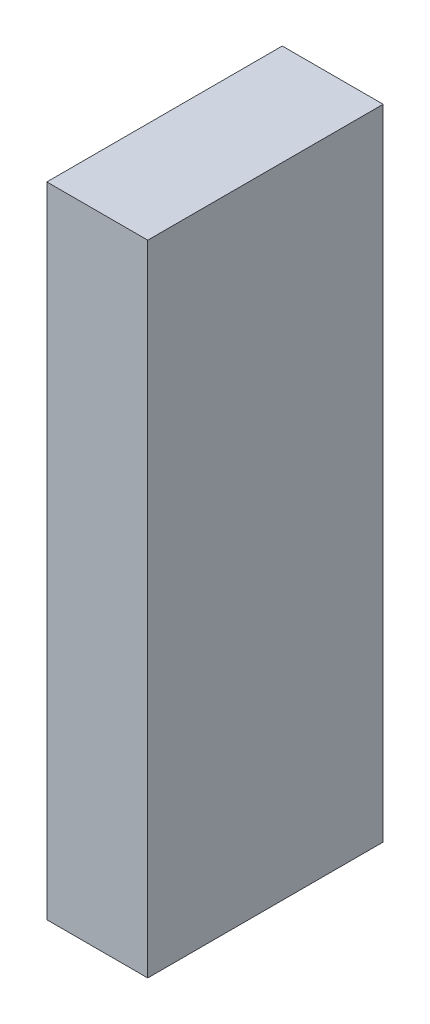
ISO-10303-21;
HEADER;
FILE_DESCRIPTION(('STEP AP214'),'2;1');
FILE_NAME('part.step','',(''),(''),'','','');
FILE_SCHEMA(('AUTOMOTIVE_DESIGN { 1 0 10303 214 1 1 1 1 }'));
ENDSEC;
DATA;
#1=APPLICATION_CONTEXT('core data for automotive mechanical design processes');
#2=APPLICATION_PROTOCOL_DEFINITION('international standard','automotive_design',2000,#1);
#3=PRODUCT_CONTEXT('',#1,'mechanical');
#4=PRODUCT('Part','Part','',(#3));
#5=PRODUCT_RELATED_PRODUCT_CATEGORY('part','',(#4));
#6=PRODUCT_DEFINITION_FORMATION('','',#4);
#7=PRODUCT_DEFINITION_CONTEXT('part definition',#1,'design');
#8=PRODUCT_DEFINITION('design','',#6,#7);
#9=PRODUCT_DEFINITION_SHAPE('','',#8);
#10=(LENGTH_UNIT() NAMED_UNIT(*) SI_UNIT(.MILLI.,.METRE.));
#11=(NAMED_UNIT(*) PLANE_ANGLE_UNIT() SI_UNIT($,.RADIAN.));
#12=(NAMED_UNIT(*) SI_UNIT($,.STERADIAN.) SOLID_ANGLE_UNIT());
#13=UNCERTAINTY_MEASURE_WITH_UNIT(LENGTH_MEASURE(1.E-05),#10,'distance_accuracy_value','');
#14=(GEOMETRIC_REPRESENTATION_CONTEXT(3) GLOBAL_UNCERTAINTY_ASSIGNED_CONTEXT((#13)) GLOBAL_UNIT_ASSIGNED_CONTEXT((#10,
#11,#12)) REPRESENTATION_CONTEXT('',''));
#15=CARTESIAN_POINT('',(0.,0.,0.));
#16=DIRECTION('',(0.,0.,1.));
#17=DIRECTION('',(1.,0.,0.));
#18=AXIS2_PLACEMENT_3D('',#15,#16,#17);
#19=CARTESIAN_POINT('',(-19.05,120.65,44.45));
#20=DIRECTION('',(1.,0.,0.));
#21=DIRECTION('',(0.,0.,-1.));
#22=AXIS2_PLACEMENT_3D('',#19,#20,#21);
#23=PLANE('',#22);
#24=DIRECTION('',(0.,0.,1.));
#25=VECTOR('',#24,1.);
#26=CARTESIAN_POINT('',(-19.05,-120.65,44.45));
#27=LINE('',#26,#25);
#28=CARTESIAN_POINT('',(-19.05,-120.65,-44.45));
#29=VERTEX_POINT('',#28);
#30=CARTESIAN_POINT('',(-19.05,-120.65,44.45));
#31=VERTEX_POINT('',#30);
#32=EDGE_CURVE('E96',#29,#31,#27,.T.);
#33=ORIENTED_EDGE('',*,*,#32,.T.);
#34=DIRECTION('',(0.,-1.,0.));
#35=VECTOR('',#34,1.);
#36=CARTESIAN_POINT('',(-19.05,120.65,44.45));
#37=LINE('',#36,#35);
#38=CARTESIAN_POINT('',(-19.05,120.65,44.45));
#39=VERTEX_POINT('',#38);
#40=EDGE_CURVE('E11',#39,#31,#37,.T.);
#41=ORIENTED_EDGE('',*,*,#40,.F.);
#42=DIRECTION('',(0.,0.,1.));
#43=VECTOR('',#42,1.);
#44=CARTESIAN_POINT('',(-19.05,120.65,44.45));
#45=LINE('',#44,#43);
#46=CARTESIAN_POINT('',(-19.05,120.65,-44.45));
#47=VERTEX_POINT('',#46);
#48=EDGE_CURVE('E84',#47,#39,#45,.T.);
#49=ORIENTED_EDGE('',*,*,#48,.F.);
#50=DIRECTION('',(0.,-1.,0.));
#51=VECTOR('',#50,1.);
#52=CARTESIAN_POINT('',(-19.05,120.65,-44.45));
#53=LINE('',#52,#51);
#54=EDGE_CURVE('E92',#47,#29,#53,.T.);
#55=ORIENTED_EDGE('',*,*,#54,.T.);
#56=EDGE_LOOP('',(#33,#41,#49,#55));
#57=FACE_BOUND('',#56,.T.);
#58=ADVANCED_FACE('F33',(#57),#23,.F.);
#59=CARTESIAN_POINT('',(19.05,120.65,44.45));
#60=DIRECTION('',(0.,0.,-1.));
#61=DIRECTION('',(-1.,0.,0.));
#62=AXIS2_PLACEMENT_3D('',#59,#60,#61);
#63=PLANE('',#62);
#64=DIRECTION('',(1.,0.,0.));
#65=VECTOR('',#64,1.);
#66=CARTESIAN_POINT('',(19.05,-120.65,44.45));
#67=LINE('',#66,#65);
#68=CARTESIAN_POINT('',(19.05,-120.65,44.45));
#69=VERTEX_POINT('',#68);
#70=EDGE_CURVE('E88',#31,#69,#67,.T.);
#71=ORIENTED_EDGE('',*,*,#70,.T.);
#72=DIRECTION('',(0.,-1.,0.));
#73=VECTOR('',#72,1.);
#74=CARTESIAN_POINT('',(19.05,120.65,44.45));
#75=LINE('',#74,#73);
#76=CARTESIAN_POINT('',(19.05,120.65,44.45));
#77=VERTEX_POINT('',#76);
#78=EDGE_CURVE('E41',#77,#69,#75,.T.);
#79=ORIENTED_EDGE('',*,*,#78,.F.);
#80=DIRECTION('',(1.,0.,0.));
#81=VECTOR('',#80,1.);
#82=CARTESIAN_POINT('',(19.05,120.65,44.45));
#83=LINE('',#82,#81);
#84=EDGE_CURVE('E79',#39,#77,#83,.T.);
#85=ORIENTED_EDGE('',*,*,#84,.F.);
#86=ORIENTED_EDGE('',*,*,#40,.T.);
#87=EDGE_LOOP('',(#71,#79,#85,#86));
#88=FACE_BOUND('',#87,.T.);
#89=ADVANCED_FACE('F87',(#88),#63,.F.);
#90=CARTESIAN_POINT('',(19.05,120.65,44.45));
#91=DIRECTION('',(-1.,0.,0.));
#92=DIRECTION('',(0.,0.,1.));
#93=AXIS2_PLACEMENT_3D('',#90,#91,#92);
#94=PLANE('',#93);
#95=DIRECTION('',(0.,0.,-1.));
#96=VECTOR('',#95,1.);
#97=CARTESIAN_POINT('',(19.05,-120.65,44.45));
#98=LINE('',#97,#96);
#99=CARTESIAN_POINT('',(19.05,-120.65,-44.45));
#100=VERTEX_POINT('',#99);
#101=EDGE_CURVE('E66',#69,#100,#98,.T.);
#102=ORIENTED_EDGE('',*,*,#101,.T.);
#103=DIRECTION('',(0.,-1.,0.));
#104=VECTOR('',#103,1.);
#105=CARTESIAN_POINT('',(19.05,120.65,-44.45));
#106=LINE('',#105,#104);
#107=CARTESIAN_POINT('',(19.05,120.65,-44.45));
#108=VERTEX_POINT('',#107);
#109=EDGE_CURVE('E89',#108,#100,#106,.T.);
#110=ORIENTED_EDGE('',*,*,#109,.F.);
#111=DIRECTION('',(0.,0.,-1.));
#112=VECTOR('',#111,1.);
#113=CARTESIAN_POINT('',(19.05,120.65,44.45));
#114=LINE('',#113,#112);
#115=EDGE_CURVE('E82',#77,#108,#114,.T.);
#116=ORIENTED_EDGE('',*,*,#115,.F.);
#117=ORIENTED_EDGE('',*,*,#78,.T.);
#118=EDGE_LOOP('',(#102,#110,#116,#117));
#119=FACE_BOUND('',#118,.T.);
#120=ADVANCED_FACE('F90',(#119),#94,.F.);
#121=CARTESIAN_POINT('',(19.05,120.65,-44.45));
#122=DIRECTION('',(0.,0.,1.));
#123=DIRECTION('',(1.,0.,0.));
#124=AXIS2_PLACEMENT_3D('',#121,#122,#123);
#125=PLANE('',#124);
#126=DIRECTION('',(-1.,0.,0.));
#127=VECTOR('',#126,1.);
#128=CARTESIAN_POINT('',(19.05,-120.65,-44.45));
#129=LINE('',#128,#127);
#130=EDGE_CURVE('E72',#100,#29,#129,.T.);
#131=ORIENTED_EDGE('',*,*,#130,.T.);
#132=ORIENTED_EDGE('',*,*,#54,.F.);
#133=DIRECTION('',(-1.,0.,0.));
#134=VECTOR('',#133,1.);
#135=CARTESIAN_POINT('',(19.05,120.65,-44.45));
#136=LINE('',#135,#134);
#137=EDGE_CURVE('E49',#108,#47,#136,.T.);
#138=ORIENTED_EDGE('',*,*,#137,.F.);
#139=ORIENTED_EDGE('',*,*,#109,.T.);
#140=EDGE_LOOP('',(#131,#132,#138,#139));
#141=FACE_BOUND('',#140,.T.);
#142=ADVANCED_FACE('F103',(#141),#125,.F.);
#143=CARTESIAN_POINT('',(0.,120.65,0.));
#144=DIRECTION('',(0.,1.,0.));
#145=DIRECTION('',(0.,0.,1.));
#146=AXIS2_PLACEMENT_3D('',#143,#144,#145);
#147=PLANE('',#146);
#148=ORIENTED_EDGE('',*,*,#48,.T.);
#149=ORIENTED_EDGE('',*,*,#84,.T.);
#150=ORIENTED_EDGE('',*,*,#115,.T.);
#151=ORIENTED_EDGE('',*,*,#137,.T.);
#152=EDGE_LOOP('',(#148,#149,#150,#151));
#153=FACE_BOUND('',#152,.T.);
#154=ADVANCED_FACE('F80',(#153),#147,.T.);
#155=CARTESIAN_POINT('',(0.,-120.65,0.));
#156=DIRECTION('',(0.,1.,0.));
#157=DIRECTION('',(0.,0.,1.));
#158=AXIS2_PLACEMENT_3D('',#155,#156,#157);
#159=PLANE('',#158);
#160=ORIENTED_EDGE('',*,*,#32,.F.);
#161=ORIENTED_EDGE('',*,*,#130,.F.);
#162=ORIENTED_EDGE('',*,*,#101,.F.);
#163=ORIENTED_EDGE('',*,*,#70,.F.);
#164=EDGE_LOOP('',(#160,#161,#162,#163));
#165=FACE_BOUND('',#164,.T.);
#166=ADVANCED_FACE('F106',(#165),#159,.F.);
#167=CLOSED_SHELL('',(#58,#89,#120,#142,#154,#166));
#168=MANIFOLD_SOLID_BREP('B2',#167);
#169=ADVANCED_BREP_SHAPE_REPRESENTATION('',(#18,#168),#14);
#170=SHAPE_DEFINITION_REPRESENTATION(#9,#169);
ENDSEC;
END-ISO-10303-21;
